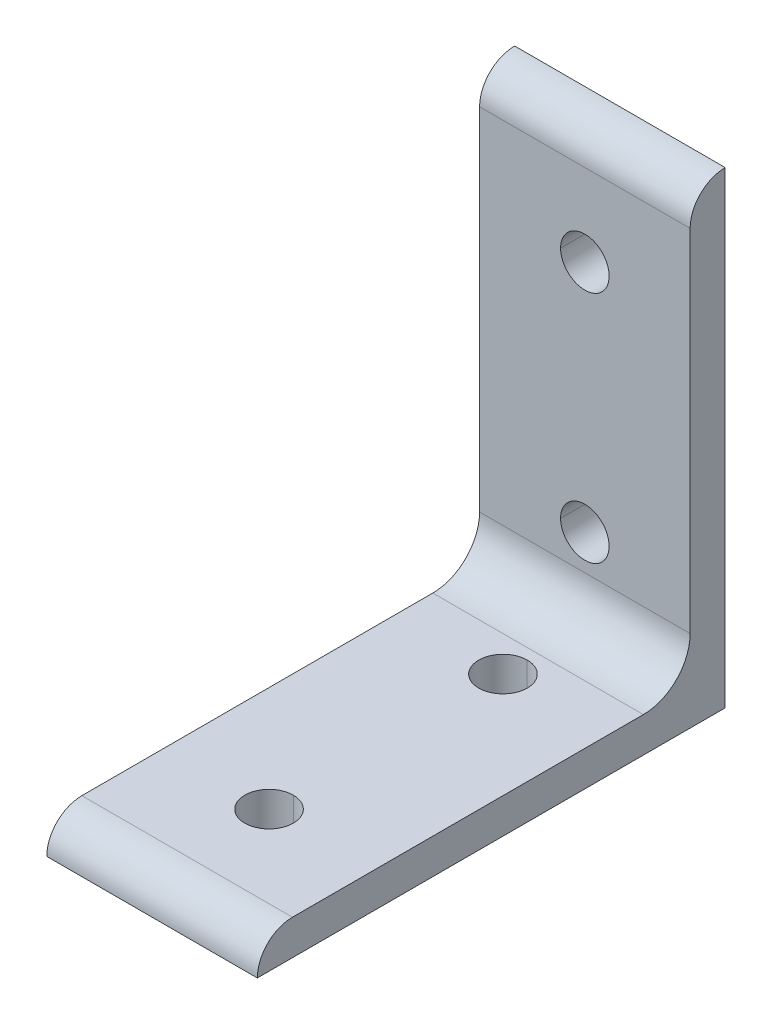
ISO-10303-21;
HEADER;
FILE_DESCRIPTION(('STEP AP214'),'2;1');
FILE_NAME('part.step','',(''),(''),'','','');
FILE_SCHEMA(('AUTOMOTIVE_DESIGN { 1 0 10303 214 1 1 1 1 }'));
ENDSEC;
DATA;
#1=APPLICATION_CONTEXT('core data for automotive mechanical design processes');
#2=APPLICATION_PROTOCOL_DEFINITION('international standard','automotive_design',2000,#1);
#3=PRODUCT_CONTEXT('',#1,'mechanical');
#4=PRODUCT('Part','Part','',(#3));
#5=PRODUCT_RELATED_PRODUCT_CATEGORY('part','',(#4));
#6=PRODUCT_DEFINITION_FORMATION('','',#4);
#7=PRODUCT_DEFINITION_CONTEXT('part definition',#1,'design');
#8=PRODUCT_DEFINITION('design','',#6,#7);
#9=PRODUCT_DEFINITION_SHAPE('','',#8);
#10=(LENGTH_UNIT() NAMED_UNIT(*) SI_UNIT(.MILLI.,.METRE.));
#11=(NAMED_UNIT(*) PLANE_ANGLE_UNIT() SI_UNIT($,.RADIAN.));
#12=(NAMED_UNIT(*) SI_UNIT($,.STERADIAN.) SOLID_ANGLE_UNIT());
#13=UNCERTAINTY_MEASURE_WITH_UNIT(LENGTH_MEASURE(1.E-05),#10,'distance_accuracy_value','');
#14=(GEOMETRIC_REPRESENTATION_CONTEXT(3) GLOBAL_UNCERTAINTY_ASSIGNED_CONTEXT((#13)) GLOBAL_UNIT_ASSIGNED_CONTEXT((#10,
#11,#12)) REPRESENTATION_CONTEXT('',''));
#15=CARTESIAN_POINT('',(0.,0.,0.));
#16=DIRECTION('',(0.,0.,1.));
#17=DIRECTION('',(1.,0.,0.));
#18=AXIS2_PLACEMENT_3D('',#15,#16,#17);
#19=CARTESIAN_POINT('',(18.,-4.64905891561784E-13,74.));
#20=DIRECTION('',(-1.,0.,0.));
#21=DIRECTION('',(0.,-0.707106781186575,-0.70710678118652));
#22=AXIS2_PLACEMENT_3D('',#19,#20,#21);
#23=CYLINDRICAL_SURFACE('',#22,6.00000000000047);
#24=CARTESIAN_POINT('',(-18.,-4.64905891561784E-13,74.));
#25=DIRECTION('',(1.,0.,0.));
#26=DIRECTION('',(0.,0.,-1.));
#27=AXIS2_PLACEMENT_3D('',#24,#25,#26);
#28=CIRCLE('',#27,6.00000000000047);
#29=CARTESIAN_POINT('',(-18.,6.,74.));
#30=VERTEX_POINT('',#29);
#31=CARTESIAN_POINT('',(-18.,0.,80.));
#32=VERTEX_POINT('',#31);
#33=EDGE_CURVE('E10',#30,#32,#28,.T.);
#34=ORIENTED_EDGE('',*,*,#33,.T.);
#35=DIRECTION('',(-1.,0.,0.));
#36=VECTOR('',#35,1.);
#37=CARTESIAN_POINT('',(18.,0.,80.));
#38=LINE('',#37,#36);
#39=CARTESIAN_POINT('',(18.,0.,80.));
#40=VERTEX_POINT('',#39);
#41=EDGE_CURVE('E24',#40,#32,#38,.T.);
#42=ORIENTED_EDGE('',*,*,#41,.F.);
#43=CARTESIAN_POINT('',(18.,-4.64905891561784E-13,74.));
#44=DIRECTION('',(1.,0.,0.));
#45=DIRECTION('',(0.,0.,-1.));
#46=AXIS2_PLACEMENT_3D('',#43,#44,#45);
#47=CIRCLE('',#46,6.00000000000047);
#48=CARTESIAN_POINT('',(18.,6.,74.));
#49=VERTEX_POINT('',#48);
#50=EDGE_CURVE('E366',#49,#40,#47,.T.);
#51=ORIENTED_EDGE('',*,*,#50,.F.);
#52=DIRECTION('',(-1.,0.,0.));
#53=VECTOR('',#52,1.);
#54=CARTESIAN_POINT('',(18.,6.,74.));
#55=LINE('',#54,#53);
#56=EDGE_CURVE('E361',#49,#30,#55,.T.);
#57=ORIENTED_EDGE('',*,*,#56,.T.);
#58=EDGE_LOOP('',(#34,#42,#51,#57));
#59=FACE_BOUND('',#58,.T.);
#60=ADVANCED_FACE('F15',(#59),#23,.T.);
#61=CARTESIAN_POINT('',(18.,6.,14.));
#62=DIRECTION('',(0.,-1.,0.));
#63=DIRECTION('',(0.,0.,-1.));
#64=AXIS2_PLACEMENT_3D('',#61,#62,#63);
#65=PLANE('',#64);
#66=CARTESIAN_POINT('',(0.,6.,60.));
#67=DIRECTION('',(0.,1.,0.));
#68=DIRECTION('',(1.,0.,0.));
#69=AXIS2_PLACEMENT_3D('',#66,#67,#68);
#70=CIRCLE('',#69,4.15);
#71=CARTESIAN_POINT('',(0.,6.,55.85));
#72=VERTEX_POINT('',#71);
#73=CARTESIAN_POINT('',(0.,6.,64.15));
#74=VERTEX_POINT('',#73);
#75=EDGE_CURVE('E355',#72,#74,#70,.T.);
#76=ORIENTED_EDGE('',*,*,#75,.F.);
#77=CARTESIAN_POINT('',(0.,6.,60.));
#78=DIRECTION('',(0.,1.,0.));
#79=DIRECTION('',(0.,0.,1.));
#80=AXIS2_PLACEMENT_3D('',#77,#78,#79);
#81=CIRCLE('',#80,4.15000000000001);
#82=EDGE_CURVE('E349',#74,#72,#81,.T.);
#83=ORIENTED_EDGE('',*,*,#82,.F.);
#84=EDGE_LOOP('',(#76,#83));
#85=FACE_BOUND('',#84,.T.);
#86=CARTESIAN_POINT('',(0.,6.,20.));
#87=DIRECTION('',(0.,1.,0.));
#88=DIRECTION('',(1.,0.,0.));
#89=AXIS2_PLACEMENT_3D('',#86,#87,#88);
#90=CIRCLE('',#89,4.15);
#91=CARTESIAN_POINT('',(0.,6.,15.85));
#92=VERTEX_POINT('',#91);
#93=CARTESIAN_POINT('',(0.,6.,24.15));
#94=VERTEX_POINT('',#93);
#95=EDGE_CURVE('E344',#92,#94,#90,.T.);
#96=ORIENTED_EDGE('',*,*,#95,.F.);
#97=CARTESIAN_POINT('',(0.,6.,20.));
#98=DIRECTION('',(0.,1.,0.));
#99=DIRECTION('',(0.,0.,1.));
#100=AXIS2_PLACEMENT_3D('',#97,#98,#99);
#101=CIRCLE('',#100,4.15);
#102=EDGE_CURVE('E172',#94,#92,#101,.T.);
#103=ORIENTED_EDGE('',*,*,#102,.F.);
#104=EDGE_LOOP('',(#96,#103));
#105=FACE_BOUND('',#104,.T.);
#106=DIRECTION('',(0.,0.,1.));
#107=VECTOR('',#106,1.);
#108=CARTESIAN_POINT('',(-18.,6.,14.));
#109=LINE('',#108,#107);
#110=CARTESIAN_POINT('',(-18.,6.,14.));
#111=VERTEX_POINT('',#110);
#112=EDGE_CURVE('E334',#111,#30,#109,.T.);
#113=ORIENTED_EDGE('',*,*,#112,.T.);
#114=ORIENTED_EDGE('',*,*,#56,.F.);
#115=DIRECTION('',(0.,0.,1.));
#116=VECTOR('',#115,1.);
#117=CARTESIAN_POINT('',(18.,6.,14.));
#118=LINE('',#117,#116);
#119=CARTESIAN_POINT('',(18.,6.,14.));
#120=VERTEX_POINT('',#119);
#121=EDGE_CURVE('E328',#120,#49,#118,.T.);
#122=ORIENTED_EDGE('',*,*,#121,.F.);
#123=DIRECTION('',(-1.,0.,0.));
#124=VECTOR('',#123,1.);
#125=CARTESIAN_POINT('',(18.,6.,14.));
#126=LINE('',#125,#124);
#127=EDGE_CURVE('E323',#120,#111,#126,.T.);
#128=ORIENTED_EDGE('',*,*,#127,.T.);
#129=EDGE_LOOP('',(#113,#114,#122,#128));
#130=FACE_BOUND('',#129,.T.);
#131=ADVANCED_FACE('F385',(#85,#105,#130),#65,.F.);
#132=CARTESIAN_POINT('',(18.,14.,14.));
#133=DIRECTION('',(-1.,0.,0.));
#134=DIRECTION('',(0.,0.707106781186548,0.707106781186548));
#135=AXIS2_PLACEMENT_3D('',#132,#133,#134);
#136=CYLINDRICAL_SURFACE('',#135,8.);
#137=CARTESIAN_POINT('',(-18.,14.,14.));
#138=DIRECTION('',(1.,0.,0.));
#139=DIRECTION('',(0.,0.,-1.));
#140=AXIS2_PLACEMENT_3D('',#137,#138,#139);
#141=CIRCLE('',#140,8.);
#142=CARTESIAN_POINT('',(-18.,14.,6.));
#143=VERTEX_POINT('',#142);
#144=EDGE_CURVE('E318',#111,#143,#141,.T.);
#145=ORIENTED_EDGE('',*,*,#144,.F.);
#146=ORIENTED_EDGE('',*,*,#127,.F.);
#147=CARTESIAN_POINT('',(18.,14.,14.));
#148=DIRECTION('',(1.,0.,0.));
#149=DIRECTION('',(0.,0.,-1.));
#150=AXIS2_PLACEMENT_3D('',#147,#148,#149);
#151=CIRCLE('',#150,8.);
#152=CARTESIAN_POINT('',(18.,14.,6.));
#153=VERTEX_POINT('',#152);
#154=EDGE_CURVE('E313',#120,#153,#151,.T.);
#155=ORIENTED_EDGE('',*,*,#154,.T.);
#156=DIRECTION('',(-1.,0.,0.));
#157=VECTOR('',#156,1.);
#158=CARTESIAN_POINT('',(18.,14.,6.));
#159=LINE('',#158,#157);
#160=EDGE_CURVE('E308',#153,#143,#159,.T.);
#161=ORIENTED_EDGE('',*,*,#160,.T.);
#162=EDGE_LOOP('',(#145,#146,#155,#161));
#163=FACE_BOUND('',#162,.T.);
#164=ADVANCED_FACE('F402',(#163),#136,.F.);
#165=CARTESIAN_POINT('',(18.,74.,6.));
#166=DIRECTION('',(0.,0.,-1.));
#167=DIRECTION('',(-1.,0.,0.));
#168=AXIS2_PLACEMENT_3D('',#165,#166,#167);
#169=PLANE('',#168);
#170=CARTESIAN_POINT('',(0.,60.,6.));
#171=DIRECTION('',(0.,0.,1.));
#172=DIRECTION('',(1.,0.,0.));
#173=AXIS2_PLACEMENT_3D('',#170,#171,#172);
#174=CIRCLE('',#173,4.15);
#175=CARTESIAN_POINT('',(-4.15,60.,6.));
#176=VERTEX_POINT('',#175);
#177=CARTESIAN_POINT('',(4.15,60.,6.));
#178=VERTEX_POINT('',#177);
#179=EDGE_CURVE('E302',#176,#178,#174,.T.);
#180=ORIENTED_EDGE('',*,*,#179,.F.);
#181=CARTESIAN_POINT('',(0.,60.,6.));
#182=DIRECTION('',(0.,0.,1.));
#183=DIRECTION('',(1.,0.,0.));
#184=AXIS2_PLACEMENT_3D('',#181,#182,#183);
#185=CIRCLE('',#184,4.15);
#186=EDGE_CURVE('E296',#178,#176,#185,.T.);
#187=ORIENTED_EDGE('',*,*,#186,.F.);
#188=EDGE_LOOP('',(#180,#187));
#189=FACE_BOUND('',#188,.T.);
#190=CARTESIAN_POINT('',(0.,20.,6.));
#191=DIRECTION('',(0.,0.,1.));
#192=DIRECTION('',(1.,0.,0.));
#193=AXIS2_PLACEMENT_3D('',#190,#191,#192);
#194=CIRCLE('',#193,4.15);
#195=CARTESIAN_POINT('',(-4.15,20.,6.));
#196=VERTEX_POINT('',#195);
#197=CARTESIAN_POINT('',(4.15,20.,6.));
#198=VERTEX_POINT('',#197);
#199=EDGE_CURVE('E290',#196,#198,#194,.T.);
#200=ORIENTED_EDGE('',*,*,#199,.F.);
#201=CARTESIAN_POINT('',(0.,20.,6.));
#202=DIRECTION('',(0.,0.,1.));
#203=DIRECTION('',(1.,0.,0.));
#204=AXIS2_PLACEMENT_3D('',#201,#202,#203);
#205=CIRCLE('',#204,4.15);
#206=EDGE_CURVE('E284',#198,#196,#205,.T.);
#207=ORIENTED_EDGE('',*,*,#206,.F.);
#208=EDGE_LOOP('',(#200,#207));
#209=FACE_BOUND('',#208,.T.);
#210=DIRECTION('',(0.,-1.,0.));
#211=VECTOR('',#210,1.);
#212=CARTESIAN_POINT('',(-18.,74.,6.));
#213=LINE('',#212,#211);
#214=CARTESIAN_POINT('',(-18.,74.,6.));
#215=VERTEX_POINT('',#214);
#216=EDGE_CURVE('E278',#215,#143,#213,.T.);
#217=ORIENTED_EDGE('',*,*,#216,.T.);
#218=ORIENTED_EDGE('',*,*,#160,.F.);
#219=DIRECTION('',(0.,-1.,0.));
#220=VECTOR('',#219,1.);
#221=CARTESIAN_POINT('',(18.,74.,6.));
#222=LINE('',#221,#220);
#223=CARTESIAN_POINT('',(18.,74.,6.));
#224=VERTEX_POINT('',#223);
#225=EDGE_CURVE('E272',#224,#153,#222,.T.);
#226=ORIENTED_EDGE('',*,*,#225,.F.);
#227=DIRECTION('',(-1.,0.,0.));
#228=VECTOR('',#227,1.);
#229=CARTESIAN_POINT('',(18.,74.,6.));
#230=LINE('',#229,#228);
#231=EDGE_CURVE('E267',#224,#215,#230,.T.);
#232=ORIENTED_EDGE('',*,*,#231,.T.);
#233=EDGE_LOOP('',(#217,#218,#226,#232));
#234=FACE_BOUND('',#233,.T.);
#235=ADVANCED_FACE('F400',(#189,#209,#234),#169,.F.);
#236=CARTESIAN_POINT('',(18.,74.,-4.65339572430779E-13));
#237=DIRECTION('',(-1.,0.,0.));
#238=DIRECTION('',(0.,-0.70710678118652,-0.707106781186575));
#239=AXIS2_PLACEMENT_3D('',#236,#237,#238);
#240=CYLINDRICAL_SURFACE('',#239,6.00000000000046);
#241=CARTESIAN_POINT('',(-18.,74.,-4.65339572430779E-13));
#242=DIRECTION('',(1.,0.,0.));
#243=DIRECTION('',(0.,0.,-1.));
#244=AXIS2_PLACEMENT_3D('',#241,#242,#243);
#245=CIRCLE('',#244,6.00000000000046);
#246=CARTESIAN_POINT('',(-18.,80.,0.));
#247=VERTEX_POINT('',#246);
#248=EDGE_CURVE('E261',#247,#215,#245,.T.);
#249=ORIENTED_EDGE('',*,*,#248,.T.);
#250=ORIENTED_EDGE('',*,*,#231,.F.);
#251=CARTESIAN_POINT('',(18.,74.,-4.65339572430779E-13));
#252=DIRECTION('',(1.,0.,0.));
#253=DIRECTION('',(0.,0.,-1.));
#254=AXIS2_PLACEMENT_3D('',#251,#252,#253);
#255=CIRCLE('',#254,6.00000000000046);
#256=CARTESIAN_POINT('',(18.,80.,0.));
#257=VERTEX_POINT('',#256);
#258=EDGE_CURVE('E255',#257,#224,#255,.T.);
#259=ORIENTED_EDGE('',*,*,#258,.F.);
#260=DIRECTION('',(-1.,0.,0.));
#261=VECTOR('',#260,1.);
#262=CARTESIAN_POINT('',(18.,80.,0.));
#263=LINE('',#262,#261);
#264=EDGE_CURVE('E250',#257,#247,#263,.T.);
#265=ORIENTED_EDGE('',*,*,#264,.T.);
#266=EDGE_LOOP('',(#249,#250,#259,#265));
#267=FACE_BOUND('',#266,.T.);
#268=ADVANCED_FACE('F398',(#267),#240,.T.);
#269=CARTESIAN_POINT('',(18.,0.,0.));
#270=DIRECTION('',(0.,0.,1.));
#271=DIRECTION('',(1.,0.,0.));
#272=AXIS2_PLACEMENT_3D('',#269,#270,#271);
#273=PLANE('',#272);
#274=CARTESIAN_POINT('',(0.,60.,0.));
#275=DIRECTION('',(0.,0.,1.));
#276=DIRECTION('',(1.,0.,0.));
#277=AXIS2_PLACEMENT_3D('',#274,#275,#276);
#278=CIRCLE('',#277,4.15);
#279=CARTESIAN_POINT('',(4.15,60.,0.));
#280=VERTEX_POINT('',#279);
#281=CARTESIAN_POINT('',(-4.15,60.,0.));
#282=VERTEX_POINT('',#281);
#283=EDGE_CURVE('E245',#280,#282,#278,.T.);
#284=ORIENTED_EDGE('',*,*,#283,.T.);
#285=CARTESIAN_POINT('',(0.,60.,0.));
#286=DIRECTION('',(0.,0.,1.));
#287=DIRECTION('',(1.,0.,0.));
#288=AXIS2_PLACEMENT_3D('',#285,#286,#287);
#289=CIRCLE('',#288,4.15);
#290=EDGE_CURVE('E240',#282,#280,#289,.T.);
#291=ORIENTED_EDGE('',*,*,#290,.T.);
#292=EDGE_LOOP('',(#284,#291));
#293=FACE_BOUND('',#292,.T.);
#294=CARTESIAN_POINT('',(0.,20.,0.));
#295=DIRECTION('',(0.,0.,1.));
#296=DIRECTION('',(1.,0.,0.));
#297=AXIS2_PLACEMENT_3D('',#294,#295,#296);
#298=CIRCLE('',#297,4.15);
#299=CARTESIAN_POINT('',(4.15,20.,0.));
#300=VERTEX_POINT('',#299);
#301=CARTESIAN_POINT('',(-4.15,20.,0.));
#302=VERTEX_POINT('',#301);
#303=EDGE_CURVE('E235',#300,#302,#298,.T.);
#304=ORIENTED_EDGE('',*,*,#303,.T.);
#305=CARTESIAN_POINT('',(0.,20.,0.));
#306=DIRECTION('',(0.,0.,1.));
#307=DIRECTION('',(1.,0.,0.));
#308=AXIS2_PLACEMENT_3D('',#305,#306,#307);
#309=CIRCLE('',#308,4.15);
#310=EDGE_CURVE('E230',#302,#300,#309,.T.);
#311=ORIENTED_EDGE('',*,*,#310,.T.);
#312=EDGE_LOOP('',(#304,#311));
#313=FACE_BOUND('',#312,.T.);
#314=DIRECTION('',(0.,1.,0.));
#315=VECTOR('',#314,1.);
#316=CARTESIAN_POINT('',(-18.,0.,0.));
#317=LINE('',#316,#315);
#318=CARTESIAN_POINT('',(-18.,0.,0.));
#319=VERTEX_POINT('',#318);
#320=EDGE_CURVE('E224',#319,#247,#317,.T.);
#321=ORIENTED_EDGE('',*,*,#320,.T.);
#322=ORIENTED_EDGE('',*,*,#264,.F.);
#323=DIRECTION('',(0.,1.,0.));
#324=VECTOR('',#323,1.);
#325=CARTESIAN_POINT('',(18.,0.,0.));
#326=LINE('',#325,#324);
#327=CARTESIAN_POINT('',(18.,0.,0.));
#328=VERTEX_POINT('',#327);
#329=EDGE_CURVE('E218',#328,#257,#326,.T.);
#330=ORIENTED_EDGE('',*,*,#329,.F.);
#331=DIRECTION('',(-1.,0.,0.));
#332=VECTOR('',#331,1.);
#333=CARTESIAN_POINT('',(18.,0.,0.));
#334=LINE('',#333,#332);
#335=EDGE_CURVE('E213',#328,#319,#334,.T.);
#336=ORIENTED_EDGE('',*,*,#335,.T.);
#337=EDGE_LOOP('',(#321,#322,#330,#336));
#338=FACE_BOUND('',#337,.T.);
#339=ADVANCED_FACE('F394',(#293,#313,#338),#273,.F.);
#340=CARTESIAN_POINT('',(18.,0.,80.));
#341=DIRECTION('',(0.,1.,0.));
#342=DIRECTION('',(0.,0.,1.));
#343=AXIS2_PLACEMENT_3D('',#340,#341,#342);
#344=PLANE('',#343);
#345=CARTESIAN_POINT('',(0.,0.,60.));
#346=DIRECTION('',(0.,1.,0.));
#347=DIRECTION('',(1.,0.,0.));
#348=AXIS2_PLACEMENT_3D('',#345,#346,#347);
#349=CIRCLE('',#348,4.15);
#350=CARTESIAN_POINT('',(0.,0.,55.85));
#351=VERTEX_POINT('',#350);
#352=CARTESIAN_POINT('',(0.,0.,64.15));
#353=VERTEX_POINT('',#352);
#354=EDGE_CURVE('E208',#351,#353,#349,.T.);
#355=ORIENTED_EDGE('',*,*,#354,.T.);
#356=CARTESIAN_POINT('',(0.,0.,60.));
#357=DIRECTION('',(0.,1.,0.));
#358=DIRECTION('',(0.,0.,1.));
#359=AXIS2_PLACEMENT_3D('',#356,#357,#358);
#360=CIRCLE('',#359,4.15000000000001);
#361=EDGE_CURVE('E169',#353,#351,#360,.T.);
#362=ORIENTED_EDGE('',*,*,#361,.T.);
#363=EDGE_LOOP('',(#355,#362));
#364=FACE_BOUND('',#363,.T.);
#365=CARTESIAN_POINT('',(0.,0.,20.));
#366=DIRECTION('',(0.,1.,0.));
#367=DIRECTION('',(1.,0.,0.));
#368=AXIS2_PLACEMENT_3D('',#365,#366,#367);
#369=CIRCLE('',#368,4.15);
#370=CARTESIAN_POINT('',(0.,0.,15.85));
#371=VERTEX_POINT('',#370);
#372=CARTESIAN_POINT('',(0.,0.,24.15));
#373=VERTEX_POINT('',#372);
#374=EDGE_CURVE('E153',#371,#373,#369,.T.);
#375=ORIENTED_EDGE('',*,*,#374,.T.);
#376=CARTESIAN_POINT('',(0.,0.,20.));
#377=DIRECTION('',(0.,1.,0.));
#378=DIRECTION('',(0.,0.,1.));
#379=AXIS2_PLACEMENT_3D('',#376,#377,#378);
#380=CIRCLE('',#379,4.15);
#381=EDGE_CURVE('E149',#373,#371,#380,.T.);
#382=ORIENTED_EDGE('',*,*,#381,.T.);
#383=EDGE_LOOP('',(#375,#382));
#384=FACE_BOUND('',#383,.T.);
#385=DIRECTION('',(0.,0.,-1.));
#386=VECTOR('',#385,1.);
#387=CARTESIAN_POINT('',(-18.,0.,80.));
#388=LINE('',#387,#386);
#389=EDGE_CURVE('E159',#32,#319,#388,.T.);
#390=ORIENTED_EDGE('',*,*,#389,.T.);
#391=ORIENTED_EDGE('',*,*,#335,.F.);
#392=DIRECTION('',(0.,0.,-1.));
#393=VECTOR('',#392,1.);
#394=CARTESIAN_POINT('',(18.,0.,80.));
#395=LINE('',#394,#393);
#396=EDGE_CURVE('E179',#40,#328,#395,.T.);
#397=ORIENTED_EDGE('',*,*,#396,.F.);
#398=ORIENTED_EDGE('',*,*,#41,.T.);
#399=EDGE_LOOP('',(#390,#391,#397,#398));
#400=FACE_BOUND('',#399,.T.);
#401=ADVANCED_FACE('F151',(#364,#384,#400),#344,.F.);
#402=CARTESIAN_POINT('',(18.,-4.64905891561784E-13,74.));
#403=DIRECTION('',(1.,0.,0.));
#404=DIRECTION('',(0.,0.,-1.));
#405=AXIS2_PLACEMENT_3D('',#402,#403,#404);
#406=PLANE('',#405);
#407=ORIENTED_EDGE('',*,*,#50,.T.);
#408=ORIENTED_EDGE('',*,*,#396,.T.);
#409=ORIENTED_EDGE('',*,*,#329,.T.);
#410=ORIENTED_EDGE('',*,*,#258,.T.);
#411=ORIENTED_EDGE('',*,*,#225,.T.);
#412=ORIENTED_EDGE('',*,*,#154,.F.);
#413=ORIENTED_EDGE('',*,*,#121,.T.);
#414=EDGE_LOOP('',(#407,#408,#409,#410,#411,#412,#413));
#415=FACE_BOUND('',#414,.T.);
#416=ADVANCED_FACE('F380',(#415),#406,.T.);
#417=CARTESIAN_POINT('',(-18.,-4.64905891561784E-13,74.));
#418=DIRECTION('',(1.,0.,0.));
#419=DIRECTION('',(0.,0.,-1.));
#420=AXIS2_PLACEMENT_3D('',#417,#418,#419);
#421=PLANE('',#420);
#422=ORIENTED_EDGE('',*,*,#33,.F.);
#423=ORIENTED_EDGE('',*,*,#112,.F.);
#424=ORIENTED_EDGE('',*,*,#144,.T.);
#425=ORIENTED_EDGE('',*,*,#216,.F.);
#426=ORIENTED_EDGE('',*,*,#248,.F.);
#427=ORIENTED_EDGE('',*,*,#320,.F.);
#428=ORIENTED_EDGE('',*,*,#389,.F.);
#429=EDGE_LOOP('',(#422,#423,#424,#425,#426,#427,#428));
#430=FACE_BOUND('',#429,.T.);
#431=ADVANCED_FACE('F389',(#430),#421,.F.);
#432=CARTESIAN_POINT('',(0.,6.,20.));
#433=DIRECTION('',(0.,-1.,0.));
#434=DIRECTION('',(-1.,0.,0.));
#435=AXIS2_PLACEMENT_3D('',#432,#433,#434);
#436=CYLINDRICAL_SURFACE('',#435,4.15);
#437=DIRECTION('',(0.,-1.,0.));
#438=VECTOR('',#437,1.);
#439=CARTESIAN_POINT('',(0.,6.,24.15));
#440=LINE('',#439,#438);
#441=EDGE_CURVE('E167',#94,#373,#440,.T.);
#442=ORIENTED_EDGE('',*,*,#441,.F.);
#443=ORIENTED_EDGE('',*,*,#102,.T.);
#444=DIRECTION('',(0.,-1.,0.));
#445=VECTOR('',#444,1.);
#446=CARTESIAN_POINT('',(0.,6.,15.85));
#447=LINE('',#446,#445);
#448=EDGE_CURVE('E165',#92,#371,#447,.T.);
#449=ORIENTED_EDGE('',*,*,#448,.T.);
#450=ORIENTED_EDGE('',*,*,#381,.F.);
#451=EDGE_LOOP('',(#442,#443,#449,#450));
#452=FACE_BOUND('',#451,.T.);
#453=ADVANCED_FACE('F171',(#452),#436,.F.);
#454=CARTESIAN_POINT('',(0.,6.,20.));
#455=DIRECTION('',(0.,-1.,0.));
#456=DIRECTION('',(1.,0.,0.));
#457=AXIS2_PLACEMENT_3D('',#454,#455,#456);
#458=CYLINDRICAL_SURFACE('',#457,4.15);
#459=ORIENTED_EDGE('',*,*,#441,.T.);
#460=ORIENTED_EDGE('',*,*,#374,.F.);
#461=ORIENTED_EDGE('',*,*,#448,.F.);
#462=ORIENTED_EDGE('',*,*,#95,.T.);
#463=EDGE_LOOP('',(#459,#460,#461,#462));
#464=FACE_BOUND('',#463,.T.);
#465=ADVANCED_FACE('F163',(#464),#458,.F.);
#466=CARTESIAN_POINT('',(0.,6.,60.));
#467=DIRECTION('',(0.,-1.,0.));
#468=DIRECTION('',(-1.,0.,0.));
#469=AXIS2_PLACEMENT_3D('',#466,#467,#468);
#470=CYLINDRICAL_SURFACE('',#469,4.15);
#471=DIRECTION('',(0.,-1.,0.));
#472=VECTOR('',#471,1.);
#473=CARTESIAN_POINT('',(0.,6.,64.15));
#474=LINE('',#473,#472);
#475=EDGE_CURVE('E174',#74,#353,#474,.T.);
#476=ORIENTED_EDGE('',*,*,#475,.F.);
#477=ORIENTED_EDGE('',*,*,#82,.T.);
#478=DIRECTION('',(0.,-1.,0.));
#479=VECTOR('',#478,1.);
#480=CARTESIAN_POINT('',(0.,6.,55.85));
#481=LINE('',#480,#479);
#482=EDGE_CURVE('E183',#72,#351,#481,.T.);
#483=ORIENTED_EDGE('',*,*,#482,.T.);
#484=ORIENTED_EDGE('',*,*,#361,.F.);
#485=EDGE_LOOP('',(#476,#477,#483,#484));
#486=FACE_BOUND('',#485,.T.);
#487=ADVANCED_FACE('F438',(#486),#470,.F.);
#488=CARTESIAN_POINT('',(0.,6.,60.));
#489=DIRECTION('',(0.,-1.,0.));
#490=DIRECTION('',(1.,0.,0.));
#491=AXIS2_PLACEMENT_3D('',#488,#489,#490);
#492=CYLINDRICAL_SURFACE('',#491,4.15);
#493=ORIENTED_EDGE('',*,*,#475,.T.);
#494=ORIENTED_EDGE('',*,*,#354,.F.);
#495=ORIENTED_EDGE('',*,*,#482,.F.);
#496=ORIENTED_EDGE('',*,*,#75,.T.);
#497=EDGE_LOOP('',(#493,#494,#495,#496));
#498=FACE_BOUND('',#497,.T.);
#499=ADVANCED_FACE('F433',(#498),#492,.F.);
#500=CARTESIAN_POINT('',(0.,20.,6.));
#501=DIRECTION('',(0.,0.,-1.));
#502=DIRECTION('',(0.,1.,0.));
#503=AXIS2_PLACEMENT_3D('',#500,#501,#502);
#504=CYLINDRICAL_SURFACE('',#503,4.15);
#505=DIRECTION('',(0.,0.,-1.));
#506=VECTOR('',#505,1.);
#507=CARTESIAN_POINT('',(4.15,20.,6.));
#508=LINE('',#507,#506);
#509=EDGE_CURVE('E624',#198,#300,#508,.T.);
#510=ORIENTED_EDGE('',*,*,#509,.T.);
#511=ORIENTED_EDGE('',*,*,#310,.F.);
#512=DIRECTION('',(0.,0.,-1.));
#513=VECTOR('',#512,1.);
#514=CARTESIAN_POINT('',(-4.15,20.,6.));
#515=LINE('',#514,#513);
#516=EDGE_CURVE('E612',#196,#302,#515,.T.);
#517=ORIENTED_EDGE('',*,*,#516,.F.);
#518=ORIENTED_EDGE('',*,*,#199,.T.);
#519=EDGE_LOOP('',(#510,#511,#517,#518));
#520=FACE_BOUND('',#519,.T.);
#521=ADVANCED_FACE('F437',(#520),#504,.F.);
#522=CARTESIAN_POINT('',(0.,20.,6.));
#523=DIRECTION('',(0.,0.,-1.));
#524=DIRECTION('',(0.,-1.,0.));
#525=AXIS2_PLACEMENT_3D('',#522,#523,#524);
#526=CYLINDRICAL_SURFACE('',#525,4.15);
#527=ORIENTED_EDGE('',*,*,#509,.F.);
#528=ORIENTED_EDGE('',*,*,#206,.T.);
#529=ORIENTED_EDGE('',*,*,#516,.T.);
#530=ORIENTED_EDGE('',*,*,#303,.F.);
#531=EDGE_LOOP('',(#527,#528,#529,#530));
#532=FACE_BOUND('',#531,.T.);
#533=ADVANCED_FACE('F565',(#532),#526,.F.);
#534=CARTESIAN_POINT('',(0.,60.,6.));
#535=DIRECTION('',(0.,0.,-1.));
#536=DIRECTION('',(0.,1.,0.));
#537=AXIS2_PLACEMENT_3D('',#534,#535,#536);
#538=CYLINDRICAL_SURFACE('',#537,4.15);
#539=DIRECTION('',(0.,0.,-1.));
#540=VECTOR('',#539,1.);
#541=CARTESIAN_POINT('',(4.15,60.,6.));
#542=LINE('',#541,#540);
#543=EDGE_CURVE('E608',#178,#280,#542,.T.);
#544=ORIENTED_EDGE('',*,*,#543,.T.);
#545=ORIENTED_EDGE('',*,*,#290,.F.);
#546=DIRECTION('',(0.,0.,-1.));
#547=VECTOR('',#546,1.);
#548=CARTESIAN_POINT('',(-4.15,60.,6.));
#549=LINE('',#548,#547);
#550=EDGE_CURVE('E613',#176,#282,#549,.T.);
#551=ORIENTED_EDGE('',*,*,#550,.F.);
#552=ORIENTED_EDGE('',*,*,#179,.T.);
#553=EDGE_LOOP('',(#544,#545,#551,#552));
#554=FACE_BOUND('',#553,.T.);
#555=ADVANCED_FACE('F574',(#554),#538,.F.);
#556=CARTESIAN_POINT('',(0.,60.,6.));
#557=DIRECTION('',(0.,0.,-1.));
#558=DIRECTION('',(0.,-1.,0.));
#559=AXIS2_PLACEMENT_3D('',#556,#557,#558);
#560=CYLINDRICAL_SURFACE('',#559,4.15);
#561=ORIENTED_EDGE('',*,*,#543,.F.);
#562=ORIENTED_EDGE('',*,*,#186,.T.);
#563=ORIENTED_EDGE('',*,*,#550,.T.);
#564=ORIENTED_EDGE('',*,*,#283,.F.);
#565=EDGE_LOOP('',(#561,#562,#563,#564));
#566=FACE_BOUND('',#565,.T.);
#567=ADVANCED_FACE('F584',(#566),#560,.F.);
#568=CLOSED_SHELL('',(#60,#131,#164,#235,#268,#339,#401,#416,#431,#453,#465,#487,#499,#521,#533,
#555,#567));
#569=MANIFOLD_SOLID_BREP('B1',#568);
#570=ADVANCED_BREP_SHAPE_REPRESENTATION('',(#18,#569),#14);
#571=SHAPE_DEFINITION_REPRESENTATION(#9,#570);
ENDSEC;
END-ISO-10303-21;
